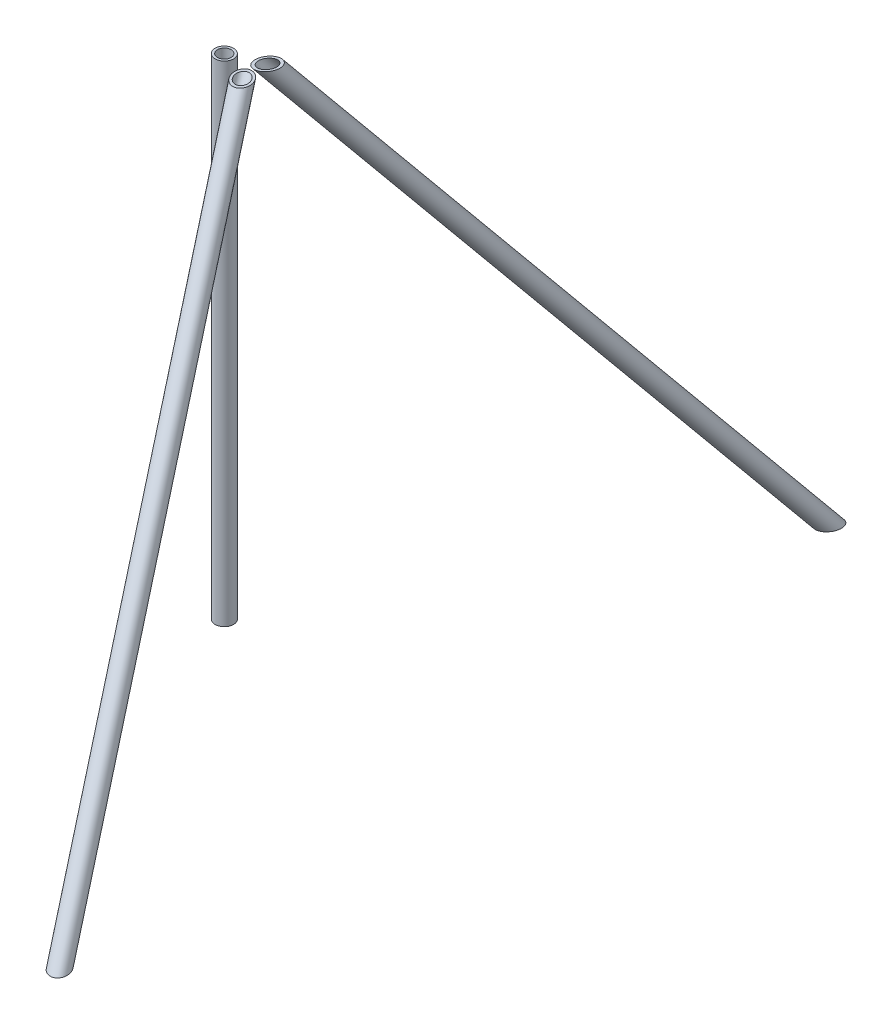
ISO-10303-21;
HEADER;
FILE_DESCRIPTION(('STEP AP214'),'2;1');
FILE_NAME('part.step','',(''),(''),'','','');
FILE_SCHEMA(('AUTOMOTIVE_DESIGN { 1 0 10303 214 1 1 1 1 }'));
ENDSEC;
DATA;
#1=APPLICATION_CONTEXT('core data for automotive mechanical design processes');
#2=APPLICATION_PROTOCOL_DEFINITION('international standard','automotive_design',2000,#1);
#3=PRODUCT_CONTEXT('',#1,'mechanical');
#4=PRODUCT('Part','Part','',(#3));
#5=PRODUCT_RELATED_PRODUCT_CATEGORY('part','',(#4));
#6=PRODUCT_DEFINITION_FORMATION('','',#4);
#7=PRODUCT_DEFINITION_CONTEXT('part definition',#1,'design');
#8=PRODUCT_DEFINITION('design','',#6,#7);
#9=PRODUCT_DEFINITION_SHAPE('','',#8);
#10=(LENGTH_UNIT() NAMED_UNIT(*) SI_UNIT(.MILLI.,.METRE.));
#11=(NAMED_UNIT(*) PLANE_ANGLE_UNIT() SI_UNIT($,.RADIAN.));
#12=(NAMED_UNIT(*) SI_UNIT($,.STERADIAN.) SOLID_ANGLE_UNIT());
#13=UNCERTAINTY_MEASURE_WITH_UNIT(LENGTH_MEASURE(1.E-05),#10,'distance_accuracy_value','');
#14=(GEOMETRIC_REPRESENTATION_CONTEXT(3) GLOBAL_UNCERTAINTY_ASSIGNED_CONTEXT((#13)) GLOBAL_UNIT_ASSIGNED_CONTEXT((#10,
#11,#12)) REPRESENTATION_CONTEXT('',''));
#15=CARTESIAN_POINT('',(0.,0.,0.));
#16=DIRECTION('',(0.,0.,1.));
#17=DIRECTION('',(1.,0.,0.));
#18=AXIS2_PLACEMENT_3D('',#15,#16,#17);
#19=CARTESIAN_POINT('',(13.9451292699681,21.4064950581311,5.14431936018456));
#20=DIRECTION('',(0.294383710597585,-0.761089593252292,-0.577997285441599));
#21=DIRECTION('',(0.,-0.604797490267115,0.796379303954214));
#22=AXIS2_PLACEMENT_3D('',#19,#20,#21);
#23=CYLINDRICAL_SURFACE('',#22,4.699);
#24=CARTESIAN_POINT('',(20.9969339622641,3.175,-8.70129716981126));
#25=DIRECTION('',(0.,-1.,0.));
#26=DIRECTION('',(0.453842868921282,0.,-0.891081730443005));
#27=AXIS2_PLACEMENT_3D('',#24,#25,#26);
#28=ELLIPSE('',#27,6.17404316346018,4.699);
#29=CARTESIAN_POINT('',(23.7989794244127,3.175,-14.2028742357372));
#30=VERTEX_POINT('',#29);
#31=EDGE_CURVE('E52',#30,#30,#28,.T.);
#32=ORIENTED_EDGE('',*,*,#31,.F.);
#33=EDGE_LOOP('',(#32));
#34=FACE_BOUND('',#33,.T.);
#35=CARTESIAN_POINT('',(151.171933962264,-333.375,-264.288797169811));
#36=DIRECTION('',(0.,-1.,0.));
#37=DIRECTION('',(0.453842868921282,0.,-0.891081730443005));
#38=AXIS2_PLACEMENT_3D('',#35,#36,#37);
#39=ELLIPSE('',#38,6.17404316346018,4.699);
#40=CARTESIAN_POINT('',(153.973979424413,-333.375,-269.790374235737));
#41=VERTEX_POINT('',#40);
#42=EDGE_CURVE('E57',#41,#41,#39,.T.);
#43=ORIENTED_EDGE('',*,*,#42,.T.);
#44=EDGE_LOOP('',(#43));
#45=FACE_BOUND('',#44,.T.);
#46=ADVANCED_FACE('F44',(#34,#45),#23,.F.);
#47=CARTESIAN_POINT('',(13.9451292699681,21.4064950581311,5.14431936018456));
#48=DIRECTION('',(0.294383710597585,-0.761089593252292,-0.577997285441599));
#49=DIRECTION('',(0.,-0.604797490267115,0.796379303954214));
#50=AXIS2_PLACEMENT_3D('',#47,#48,#49);
#51=CYLINDRICAL_SURFACE('',#50,6.35000000000001);
#52=CARTESIAN_POINT('',(20.9969339622641,3.175,-8.70129716981126));
#53=DIRECTION('',(0.,-1.,0.));
#54=DIRECTION('',(0.453842868921282,0.,-0.891081730443005));
#55=AXIS2_PLACEMENT_3D('',#52,#53,#54);
#56=ELLIPSE('',#55,8.3433015722435,6.35000000000001);
#57=CARTESIAN_POINT('',(24.7834818840866,3.175,-16.1358607724138));
#58=VERTEX_POINT('',#57);
#59=EDGE_CURVE('E12',#58,#58,#56,.T.);
#60=ORIENTED_EDGE('',*,*,#59,.T.);
#61=EDGE_LOOP('',(#60));
#62=FACE_BOUND('',#61,.T.);
#63=CARTESIAN_POINT('',(151.171933962264,-333.375,-264.288797169811));
#64=DIRECTION('',(0.,-1.,0.));
#65=DIRECTION('',(0.453842868921282,0.,-0.891081730443005));
#66=AXIS2_PLACEMENT_3D('',#63,#64,#65);
#67=ELLIPSE('',#66,8.3433015722435,6.35000000000001);
#68=CARTESIAN_POINT('',(154.958481884087,-333.375,-271.723360772414));
#69=VERTEX_POINT('',#68);
#70=EDGE_CURVE('E48',#69,#69,#67,.T.);
#71=ORIENTED_EDGE('',*,*,#70,.F.);
#72=EDGE_LOOP('',(#71));
#73=FACE_BOUND('',#72,.T.);
#74=ADVANCED_FACE('F67',(#62,#73),#51,.T.);
#75=CARTESIAN_POINT('',(0.,3.175,0.));
#76=DIRECTION('',(0.,1.,0.));
#77=DIRECTION('',(0.,0.,-1.));
#78=AXIS2_PLACEMENT_3D('',#75,#76,#77);
#79=PLANE('',#78);
#80=ORIENTED_EDGE('',*,*,#31,.T.);
#81=EDGE_LOOP('',(#80));
#82=FACE_BOUND('',#81,.T.);
#83=ORIENTED_EDGE('',*,*,#59,.F.);
#84=EDGE_LOOP('',(#83));
#85=FACE_BOUND('',#84,.T.);
#86=ADVANCED_FACE('F46',(#82,#85),#79,.T.);
#87=CARTESIAN_POINT('',(154.269336562295,-333.375,-270.370282762554));
#88=DIRECTION('',(0.,-1.,0.));
#89=DIRECTION('',(0.,0.,-1.));
#90=AXIS2_PLACEMENT_3D('',#87,#88,#89);
#91=PLANE('',#90);
#92=ORIENTED_EDGE('',*,*,#42,.F.);
#93=EDGE_LOOP('',(#92));
#94=FACE_BOUND('',#93,.T.);
#95=ORIENTED_EDGE('',*,*,#70,.T.);
#96=EDGE_LOOP('',(#95));
#97=FACE_BOUND('',#96,.T.);
#98=ADVANCED_FACE('F65',(#94,#97),#91,.T.);
#99=CLOSED_SHELL('',(#46,#74,#86,#98));
#100=MANIFOLD_SOLID_BREP('B2',#99);
#101=CARTESIAN_POINT('',(0.,-333.375,0.));
#102=DIRECTION('',(0.,1.,0.));
#103=DIRECTION('',(0.,0.,1.));
#104=AXIS2_PLACEMENT_3D('',#101,#102,#103);
#105=CYLINDRICAL_SURFACE('',#104,6.35);
#106=CARTESIAN_POINT('',(0.,-333.375,0.));
#107=DIRECTION('',(0.,1.,0.));
#108=DIRECTION('',(0.,0.,1.));
#109=AXIS2_PLACEMENT_3D('',#106,#107,#108);
#110=CIRCLE('',#109,6.35);
#111=CARTESIAN_POINT('',(0.,-333.375,6.35));
#112=VERTEX_POINT('',#111);
#113=EDGE_CURVE('E43',#112,#112,#110,.T.);
#114=ORIENTED_EDGE('',*,*,#113,.T.);
#115=EDGE_LOOP('',(#114));
#116=FACE_BOUND('',#115,.T.);
#117=CARTESIAN_POINT('',(0.,3.175,0.));
#118=DIRECTION('',(0.,1.,0.));
#119=DIRECTION('',(0.,0.,1.));
#120=AXIS2_PLACEMENT_3D('',#117,#118,#119);
#121=CIRCLE('',#120,6.35);
#122=CARTESIAN_POINT('',(0.,3.175,6.35));
#123=VERTEX_POINT('',#122);
#124=EDGE_CURVE('E134',#123,#123,#121,.T.);
#125=ORIENTED_EDGE('',*,*,#124,.F.);
#126=EDGE_LOOP('',(#125));
#127=FACE_BOUND('',#126,.T.);
#128=ADVANCED_FACE('F131',(#116,#127),#105,.T.);
#129=CARTESIAN_POINT('',(0.,-333.375,0.));
#130=DIRECTION('',(0.,1.,0.));
#131=DIRECTION('',(0.,0.,1.));
#132=AXIS2_PLACEMENT_3D('',#129,#130,#131);
#133=PLANE('',#132);
#134=CARTESIAN_POINT('',(0.,-333.375,0.));
#135=DIRECTION('',(0.,1.,0.));
#136=DIRECTION('',(0.,0.,1.));
#137=AXIS2_PLACEMENT_3D('',#134,#135,#136);
#138=CIRCLE('',#137,4.699);
#139=CARTESIAN_POINT('',(0.,-333.375,4.699));
#140=VERTEX_POINT('',#139);
#141=EDGE_CURVE('E141',#140,#140,#138,.T.);
#142=ORIENTED_EDGE('',*,*,#141,.T.);
#143=EDGE_LOOP('',(#142));
#144=FACE_BOUND('',#143,.T.);
#145=ORIENTED_EDGE('',*,*,#113,.F.);
#146=EDGE_LOOP('',(#145));
#147=FACE_BOUND('',#146,.T.);
#148=ADVANCED_FACE('F149',(#144,#147),#133,.F.);
#149=CARTESIAN_POINT('',(0.,3.175,0.));
#150=DIRECTION('',(0.,1.,0.));
#151=DIRECTION('',(0.,0.,1.));
#152=AXIS2_PLACEMENT_3D('',#149,#150,#151);
#153=PLANE('',#152);
#154=CARTESIAN_POINT('',(0.,3.175,0.));
#155=DIRECTION('',(0.,1.,0.));
#156=DIRECTION('',(0.,0.,1.));
#157=AXIS2_PLACEMENT_3D('',#154,#155,#156);
#158=CIRCLE('',#157,4.699);
#159=CARTESIAN_POINT('',(0.,3.175,4.699));
#160=VERTEX_POINT('',#159);
#161=EDGE_CURVE('E143',#160,#160,#158,.T.);
#162=ORIENTED_EDGE('',*,*,#161,.F.);
#163=EDGE_LOOP('',(#162));
#164=FACE_BOUND('',#163,.T.);
#165=ORIENTED_EDGE('',*,*,#124,.T.);
#166=EDGE_LOOP('',(#165));
#167=FACE_BOUND('',#166,.T.);
#168=ADVANCED_FACE('F155',(#164,#167),#153,.T.);
#169=CARTESIAN_POINT('',(0.,-333.375,0.));
#170=DIRECTION('',(0.,1.,0.));
#171=DIRECTION('',(0.,0.,1.));
#172=AXIS2_PLACEMENT_3D('',#169,#170,#171);
#173=CYLINDRICAL_SURFACE('',#172,4.699);
#174=ORIENTED_EDGE('',*,*,#141,.F.);
#175=EDGE_LOOP('',(#174));
#176=FACE_BOUND('',#175,.T.);
#177=ORIENTED_EDGE('',*,*,#161,.T.);
#178=EDGE_LOOP('',(#177));
#179=FACE_BOUND('',#178,.T.);
#180=ADVANCED_FACE('F152',(#176,#179),#173,.F.);
#181=CLOSED_SHELL('',(#128,#148,#168,#180));
#182=MANIFOLD_SOLID_BREP('B7',#181);
#183=CARTESIAN_POINT('',(13.9451292699681,21.4064950581311,-5.14431936018456));
#184=DIRECTION('',(0.294383710597585,-0.761089593252292,0.577997285441599));
#185=DIRECTION('',(0.,-0.604797490267115,-0.796379303954214));
#186=AXIS2_PLACEMENT_3D('',#183,#184,#185);
#187=CYLINDRICAL_SURFACE('',#186,4.699);
#188=CARTESIAN_POINT('',(20.9969339622641,3.175,8.70129716981126));
#189=DIRECTION('',(0.,1.,0.));
#190=DIRECTION('',(0.453842868921282,0.,0.891081730443005));
#191=AXIS2_PLACEMENT_3D('',#188,#189,#190);
#192=ELLIPSE('',#191,6.17404316346018,4.699);
#193=CARTESIAN_POINT('',(23.7989794244127,3.175,14.2028742357372));
#194=VERTEX_POINT('',#193);
#195=EDGE_CURVE('E200',#194,#194,#192,.T.);
#196=ORIENTED_EDGE('',*,*,#195,.T.);
#197=EDGE_LOOP('',(#196));
#198=FACE_BOUND('',#197,.T.);
#199=CARTESIAN_POINT('',(151.171933962264,-333.375,264.288797169811));
#200=DIRECTION('',(0.,-1.,0.));
#201=DIRECTION('',(0.453842868921282,0.,0.891081730443005));
#202=AXIS2_PLACEMENT_3D('',#199,#200,#201);
#203=ELLIPSE('',#202,6.17404316346018,4.699);
#204=CARTESIAN_POINT('',(153.973979424413,-333.375,269.790374235737));
#205=VERTEX_POINT('',#204);
#206=EDGE_CURVE('E205',#205,#205,#203,.T.);
#207=ORIENTED_EDGE('',*,*,#206,.T.);
#208=EDGE_LOOP('',(#207));
#209=FACE_BOUND('',#208,.T.);
#210=ADVANCED_FACE('F192',(#198,#209),#187,.F.);
#211=CARTESIAN_POINT('',(13.9451292699681,21.4064950581311,-5.14431936018456));
#212=DIRECTION('',(0.294383710597585,-0.761089593252292,0.577997285441599));
#213=DIRECTION('',(0.,-0.604797490267115,-0.796379303954214));
#214=AXIS2_PLACEMENT_3D('',#211,#212,#213);
#215=CYLINDRICAL_SURFACE('',#214,6.35000000000001);
#216=CARTESIAN_POINT('',(20.9969339622641,3.175,8.70129716981126));
#217=DIRECTION('',(0.,1.,0.));
#218=DIRECTION('',(0.453842868921282,0.,0.891081730443005));
#219=AXIS2_PLACEMENT_3D('',#216,#217,#218);
#220=ELLIPSE('',#219,8.3433015722435,6.35000000000001);
#221=CARTESIAN_POINT('',(24.7834818840866,3.175,16.1358607724138));
#222=VERTEX_POINT('',#221);
#223=EDGE_CURVE('E130',#222,#222,#220,.T.);
#224=ORIENTED_EDGE('',*,*,#223,.F.);
#225=EDGE_LOOP('',(#224));
#226=FACE_BOUND('',#225,.T.);
#227=CARTESIAN_POINT('',(151.171933962264,-333.375,264.288797169811));
#228=DIRECTION('',(0.,-1.,0.));
#229=DIRECTION('',(0.453842868921282,0.,0.891081730443005));
#230=AXIS2_PLACEMENT_3D('',#227,#228,#229);
#231=ELLIPSE('',#230,8.3433015722435,6.35000000000001);
#232=CARTESIAN_POINT('',(154.958481884087,-333.375,271.723360772414));
#233=VERTEX_POINT('',#232);
#234=EDGE_CURVE('E196',#233,#233,#231,.T.);
#235=ORIENTED_EDGE('',*,*,#234,.F.);
#236=EDGE_LOOP('',(#235));
#237=FACE_BOUND('',#236,.T.);
#238=ADVANCED_FACE('F215',(#226,#237),#215,.T.);
#239=CARTESIAN_POINT('',(0.,3.175,0.));
#240=DIRECTION('',(0.,1.,0.));
#241=DIRECTION('',(0.,0.,1.));
#242=AXIS2_PLACEMENT_3D('',#239,#240,#241);
#243=PLANE('',#242);
#244=ORIENTED_EDGE('',*,*,#195,.F.);
#245=EDGE_LOOP('',(#244));
#246=FACE_BOUND('',#245,.T.);
#247=ORIENTED_EDGE('',*,*,#223,.T.);
#248=EDGE_LOOP('',(#247));
#249=FACE_BOUND('',#248,.T.);
#250=ADVANCED_FACE('F194',(#246,#249),#243,.T.);
#251=CARTESIAN_POINT('',(154.269336562295,-333.375,270.370282762554));
#252=DIRECTION('',(0.,-1.,0.));
#253=DIRECTION('',(0.,0.,-1.));
#254=AXIS2_PLACEMENT_3D('',#251,#252,#253);
#255=PLANE('',#254);
#256=ORIENTED_EDGE('',*,*,#206,.F.);
#257=EDGE_LOOP('',(#256));
#258=FACE_BOUND('',#257,.T.);
#259=ORIENTED_EDGE('',*,*,#234,.T.);
#260=EDGE_LOOP('',(#259));
#261=FACE_BOUND('',#260,.T.);
#262=ADVANCED_FACE('F213',(#258,#261),#255,.T.);
#263=CLOSED_SHELL('',(#210,#238,#250,#262));
#264=MANIFOLD_SOLID_BREP('B38',#263);
#265=ADVANCED_BREP_SHAPE_REPRESENTATION('',(#18,#100,#182,#264),#14);
#266=SHAPE_DEFINITION_REPRESENTATION(#9,#265);
ENDSEC;
END-ISO-10303-21;
